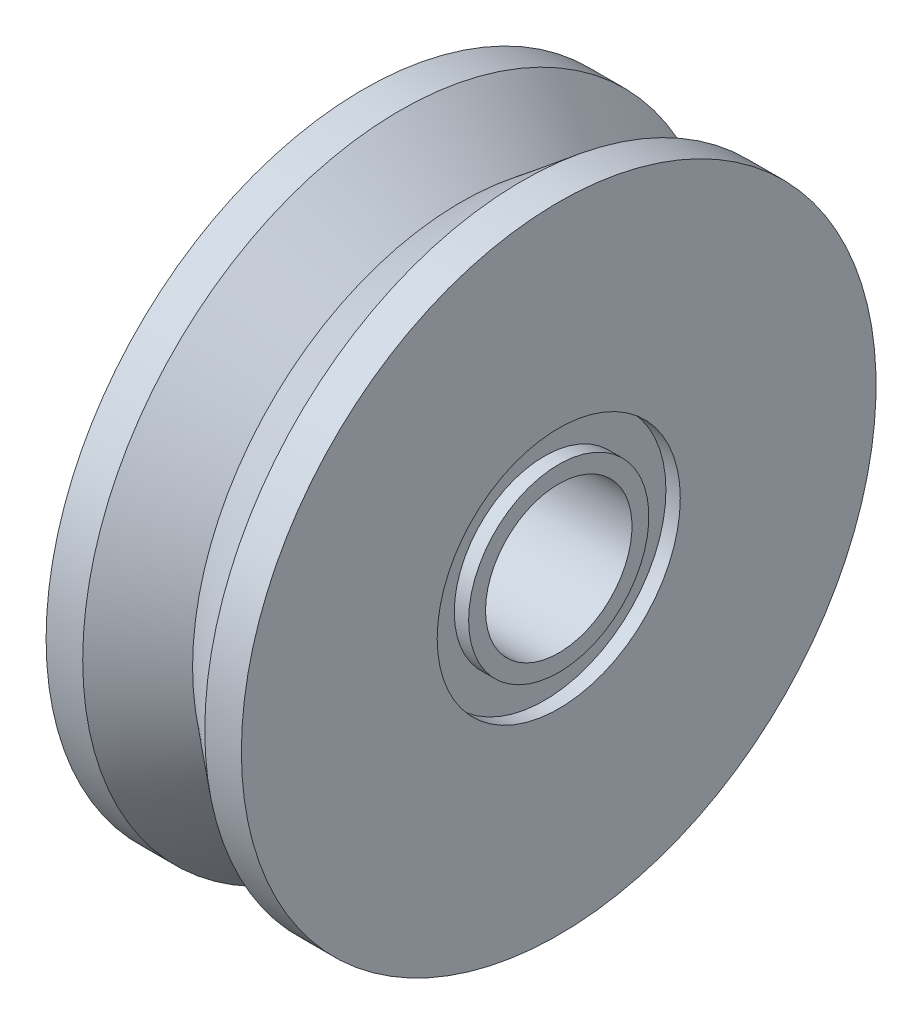
ISO-10303-21;
HEADER;
FILE_DESCRIPTION(('STEP AP214'),'2;1');
FILE_NAME('part.step','',(''),(''),'','','');
FILE_SCHEMA(('AUTOMOTIVE_DESIGN { 1 0 10303 214 1 1 1 1 }'));
ENDSEC;
DATA;
#1=APPLICATION_CONTEXT('core data for automotive mechanical design processes');
#2=APPLICATION_PROTOCOL_DEFINITION('international standard','automotive_design',2000,#1);
#3=PRODUCT_CONTEXT('',#1,'mechanical');
#4=PRODUCT('Part','Part','',(#3));
#5=PRODUCT_RELATED_PRODUCT_CATEGORY('part','',(#4));
#6=PRODUCT_DEFINITION_FORMATION('','',#4);
#7=PRODUCT_DEFINITION_CONTEXT('part definition',#1,'design');
#8=PRODUCT_DEFINITION('design','',#6,#7);
#9=PRODUCT_DEFINITION_SHAPE('','',#8);
#10=(LENGTH_UNIT() NAMED_UNIT(*) SI_UNIT(.MILLI.,.METRE.));
#11=(NAMED_UNIT(*) PLANE_ANGLE_UNIT() SI_UNIT($,.RADIAN.));
#12=(NAMED_UNIT(*) SI_UNIT($,.STERADIAN.) SOLID_ANGLE_UNIT());
#13=UNCERTAINTY_MEASURE_WITH_UNIT(LENGTH_MEASURE(1.E-05),#10,'distance_accuracy_value','');
#14=(GEOMETRIC_REPRESENTATION_CONTEXT(3) GLOBAL_UNCERTAINTY_ASSIGNED_CONTEXT((#13)) GLOBAL_UNIT_ASSIGNED_CONTEXT((#10,
#11,#12)) REPRESENTATION_CONTEXT('',''));
#15=CARTESIAN_POINT('',(0.,0.,0.));
#16=DIRECTION('',(0.,0.,1.));
#17=DIRECTION('',(1.,0.,0.));
#18=AXIS2_PLACEMENT_3D('',#15,#16,#17);
#19=CARTESIAN_POINT('',(0.,1.5,0.));
#20=DIRECTION('',(1.,0.,0.));
#21=DIRECTION('',(0.,0.,-1.));
#22=AXIS2_PLACEMENT_3D('',#19,#20,#21);
#23=PLANE('',#22);
#24=CARTESIAN_POINT('',(0.,0.,0.));
#25=DIRECTION('',(-1.,0.,0.));
#26=DIRECTION('',(0.,0.,1.));
#27=AXIS2_PLACEMENT_3D('',#24,#25,#26);
#28=CIRCLE('',#27,1.5);
#29=CARTESIAN_POINT('',(0.,0.,1.5));
#30=VERTEX_POINT('',#29);
#31=EDGE_CURVE('E77',#30,#30,#28,.T.);
#32=ORIENTED_EDGE('',*,*,#31,.F.);
#33=EDGE_LOOP('',(#32));
#34=FACE_BOUND('',#33,.T.);
#35=CARTESIAN_POINT('',(0.,0.,0.));
#36=DIRECTION('',(-1.,0.,0.));
#37=DIRECTION('',(0.,0.,1.));
#38=AXIS2_PLACEMENT_3D('',#35,#36,#37);
#39=CIRCLE('',#38,1.84615384615385);
#40=CARTESIAN_POINT('',(0.,0.,1.84615384615385));
#41=VERTEX_POINT('',#40);
#42=EDGE_CURVE('E10',#41,#41,#39,.T.);
#43=ORIENTED_EDGE('',*,*,#42,.T.);
#44=EDGE_LOOP('',(#43));
#45=FACE_BOUND('',#44,.T.);
#46=ADVANCED_FACE('F28',(#34,#45),#23,.F.);
#47=CARTESIAN_POINT('',(0.,0.,0.));
#48=DIRECTION('',(-1.,0.,0.));
#49=DIRECTION('',(0.,0.,1.));
#50=AXIS2_PLACEMENT_3D('',#47,#48,#49);
#51=CYLINDRICAL_SURFACE('',#50,1.84615384615385);
#52=ORIENTED_EDGE('',*,*,#42,.F.);
#53=EDGE_LOOP('',(#52));
#54=FACE_BOUND('',#53,.T.);
#55=CARTESIAN_POINT('',(0.293706293706293,0.,0.));
#56=DIRECTION('',(-1.,0.,0.));
#57=DIRECTION('',(0.,0.,1.));
#58=AXIS2_PLACEMENT_3D('',#55,#56,#57);
#59=CIRCLE('',#58,1.84615384615385);
#60=CARTESIAN_POINT('',(0.293706293706293,0.,1.84615384615385));
#61=VERTEX_POINT('',#60);
#62=EDGE_CURVE('E34',#61,#61,#59,.T.);
#63=ORIENTED_EDGE('',*,*,#62,.T.);
#64=EDGE_LOOP('',(#63));
#65=FACE_BOUND('',#64,.T.);
#66=ADVANCED_FACE('F84',(#54,#65),#51,.T.);
#67=CARTESIAN_POINT('',(0.293706293706293,1.84615384615385,0.));
#68=DIRECTION('',(1.,0.,0.));
#69=DIRECTION('',(0.,0.,-1.));
#70=AXIS2_PLACEMENT_3D('',#67,#68,#69);
#71=PLANE('',#70);
#72=ORIENTED_EDGE('',*,*,#62,.F.);
#73=EDGE_LOOP('',(#72));
#74=FACE_BOUND('',#73,.T.);
#75=CARTESIAN_POINT('',(0.293706293706293,0.,0.));
#76=DIRECTION('',(-1.,0.,0.));
#77=DIRECTION('',(0.,0.,1.));
#78=AXIS2_PLACEMENT_3D('',#75,#76,#77);
#79=CIRCLE('',#78,2.48951048951049);
#80=CARTESIAN_POINT('',(0.293706293706293,0.,2.48951048951049));
#81=VERTEX_POINT('',#80);
#82=EDGE_CURVE('E38',#81,#81,#79,.T.);
#83=ORIENTED_EDGE('',*,*,#82,.T.);
#84=EDGE_LOOP('',(#83));
#85=FACE_BOUND('',#84,.T.);
#86=ADVANCED_FACE('F88',(#74,#85),#71,.F.);
#87=CARTESIAN_POINT('',(0.,0.,0.));
#88=DIRECTION('',(-1.,0.,0.));
#89=DIRECTION('',(0.,0.,1.));
#90=AXIS2_PLACEMENT_3D('',#87,#88,#89);
#91=CYLINDRICAL_SURFACE('',#90,2.48951048951049);
#92=ORIENTED_EDGE('',*,*,#82,.F.);
#93=EDGE_LOOP('',(#92));
#94=FACE_BOUND('',#93,.T.);
#95=CARTESIAN_POINT('',(0.,0.,0.));
#96=DIRECTION('',(-1.,0.,0.));
#97=DIRECTION('',(0.,0.,1.));
#98=AXIS2_PLACEMENT_3D('',#95,#96,#97);
#99=CIRCLE('',#98,2.48951048951049);
#100=CARTESIAN_POINT('',(0.,0.,2.48951048951049));
#101=VERTEX_POINT('',#100);
#102=EDGE_CURVE('E42',#101,#101,#99,.T.);
#103=ORIENTED_EDGE('',*,*,#102,.T.);
#104=EDGE_LOOP('',(#103));
#105=FACE_BOUND('',#104,.T.);
#106=ADVANCED_FACE('F93',(#94,#105),#91,.F.);
#107=CARTESIAN_POINT('',(0.,2.48951048951049,0.));
#108=DIRECTION('',(1.,0.,0.));
#109=DIRECTION('',(0.,0.,-1.));
#110=AXIS2_PLACEMENT_3D('',#107,#108,#109);
#111=PLANE('',#110);
#112=ORIENTED_EDGE('',*,*,#102,.F.);
#113=EDGE_LOOP('',(#112));
#114=FACE_BOUND('',#113,.T.);
#115=CARTESIAN_POINT('',(0.,0.,0.));
#116=DIRECTION('',(-1.,0.,0.));
#117=DIRECTION('',(0.,0.,1.));
#118=AXIS2_PLACEMENT_3D('',#115,#116,#117);
#119=CIRCLE('',#118,6.5);
#120=CARTESIAN_POINT('',(0.,0.,6.5));
#121=VERTEX_POINT('',#120);
#122=EDGE_CURVE('E47',#121,#121,#119,.T.);
#123=ORIENTED_EDGE('',*,*,#122,.T.);
#124=EDGE_LOOP('',(#123));
#125=FACE_BOUND('',#124,.T.);
#126=ADVANCED_FACE('F99',(#114,#125),#111,.F.);
#127=CARTESIAN_POINT('',(0.,0.,0.));
#128=DIRECTION('',(-1.,0.,0.));
#129=DIRECTION('',(0.,0.,1.));
#130=AXIS2_PLACEMENT_3D('',#127,#128,#129);
#131=CYLINDRICAL_SURFACE('',#130,6.5);
#132=ORIENTED_EDGE('',*,*,#122,.F.);
#133=EDGE_LOOP('',(#132));
#134=FACE_BOUND('',#133,.T.);
#135=CARTESIAN_POINT('',(0.75,0.,0.));
#136=DIRECTION('',(-1.,0.,0.));
#137=DIRECTION('',(0.,0.,1.));
#138=AXIS2_PLACEMENT_3D('',#135,#136,#137);
#139=CIRCLE('',#138,6.5);
#140=CARTESIAN_POINT('',(0.75,0.,6.5));
#141=VERTEX_POINT('',#140);
#142=EDGE_CURVE('E50',#141,#141,#139,.T.);
#143=ORIENTED_EDGE('',*,*,#142,.T.);
#144=EDGE_LOOP('',(#143));
#145=FACE_BOUND('',#144,.T.);
#146=ADVANCED_FACE('F103',(#134,#145),#131,.T.);
#147=CARTESIAN_POINT('',(2.,0.,0.));
#148=DIRECTION('',(-1.,0.,0.));
#149=DIRECTION('',(0.,0.,1.));
#150=AXIS2_PLACEMENT_3D('',#147,#148,#149);
#151=CONICAL_SURFACE('',#150,5.5,0.674740942223553);
#152=ORIENTED_EDGE('',*,*,#142,.F.);
#153=EDGE_LOOP('',(#152));
#154=FACE_BOUND('',#153,.T.);
#155=CARTESIAN_POINT('',(2.,0.,0.));
#156=DIRECTION('',(-1.,0.,0.));
#157=DIRECTION('',(0.,0.,1.));
#158=AXIS2_PLACEMENT_3D('',#155,#156,#157);
#159=CIRCLE('',#158,5.5);
#160=CARTESIAN_POINT('',(2.,0.,5.5));
#161=VERTEX_POINT('',#160);
#162=EDGE_CURVE('E53',#161,#161,#159,.T.);
#163=ORIENTED_EDGE('',*,*,#162,.T.);
#164=EDGE_LOOP('',(#163));
#165=FACE_BOUND('',#164,.T.);
#166=ADVANCED_FACE('F107',(#154,#165),#151,.T.);
#167=CARTESIAN_POINT('',(3.25,0.,0.));
#168=DIRECTION('',(1.,0.,0.));
#169=DIRECTION('',(0.,0.,-1.));
#170=AXIS2_PLACEMENT_3D('',#167,#168,#169);
#171=CONICAL_SURFACE('',#170,6.5,0.674740942223553);
#172=ORIENTED_EDGE('',*,*,#162,.F.);
#173=EDGE_LOOP('',(#172));
#174=FACE_BOUND('',#173,.T.);
#175=CARTESIAN_POINT('',(3.25,0.,0.));
#176=DIRECTION('',(-1.,0.,0.));
#177=DIRECTION('',(0.,0.,1.));
#178=AXIS2_PLACEMENT_3D('',#175,#176,#177);
#179=CIRCLE('',#178,6.5);
#180=CARTESIAN_POINT('',(3.25,0.,6.5));
#181=VERTEX_POINT('',#180);
#182=EDGE_CURVE('E56',#181,#181,#179,.T.);
#183=ORIENTED_EDGE('',*,*,#182,.T.);
#184=EDGE_LOOP('',(#183));
#185=FACE_BOUND('',#184,.T.);
#186=ADVANCED_FACE('F111',(#174,#185),#171,.T.);
#187=CARTESIAN_POINT('',(0.,0.,0.));
#188=DIRECTION('',(-1.,0.,0.));
#189=DIRECTION('',(0.,0.,1.));
#190=AXIS2_PLACEMENT_3D('',#187,#188,#189);
#191=CYLINDRICAL_SURFACE('',#190,6.5);
#192=ORIENTED_EDGE('',*,*,#182,.F.);
#193=EDGE_LOOP('',(#192));
#194=FACE_BOUND('',#193,.T.);
#195=CARTESIAN_POINT('',(4.,0.,0.));
#196=DIRECTION('',(-1.,0.,0.));
#197=DIRECTION('',(0.,0.,1.));
#198=AXIS2_PLACEMENT_3D('',#195,#196,#197);
#199=CIRCLE('',#198,6.5);
#200=CARTESIAN_POINT('',(4.,0.,6.5));
#201=VERTEX_POINT('',#200);
#202=EDGE_CURVE('E59',#201,#201,#199,.T.);
#203=ORIENTED_EDGE('',*,*,#202,.T.);
#204=EDGE_LOOP('',(#203));
#205=FACE_BOUND('',#204,.T.);
#206=ADVANCED_FACE('F115',(#194,#205),#191,.T.);
#207=CARTESIAN_POINT('',(4.,2.48951048951049,0.));
#208=DIRECTION('',(-1.,0.,0.));
#209=DIRECTION('',(0.,0.,1.));
#210=AXIS2_PLACEMENT_3D('',#207,#208,#209);
#211=PLANE('',#210);
#212=ORIENTED_EDGE('',*,*,#202,.F.);
#213=EDGE_LOOP('',(#212));
#214=FACE_BOUND('',#213,.T.);
#215=CARTESIAN_POINT('',(4.,0.,0.));
#216=DIRECTION('',(-1.,0.,0.));
#217=DIRECTION('',(0.,0.,1.));
#218=AXIS2_PLACEMENT_3D('',#215,#216,#217);
#219=CIRCLE('',#218,2.48951048951049);
#220=CARTESIAN_POINT('',(4.,0.,2.48951048951049));
#221=VERTEX_POINT('',#220);
#222=EDGE_CURVE('E62',#221,#221,#219,.T.);
#223=ORIENTED_EDGE('',*,*,#222,.T.);
#224=EDGE_LOOP('',(#223));
#225=FACE_BOUND('',#224,.T.);
#226=ADVANCED_FACE('F119',(#214,#225),#211,.F.);
#227=CARTESIAN_POINT('',(0.,0.,0.));
#228=DIRECTION('',(-1.,0.,0.));
#229=DIRECTION('',(0.,0.,1.));
#230=AXIS2_PLACEMENT_3D('',#227,#228,#229);
#231=CYLINDRICAL_SURFACE('',#230,2.48951048951049);
#232=ORIENTED_EDGE('',*,*,#222,.F.);
#233=EDGE_LOOP('',(#232));
#234=FACE_BOUND('',#233,.T.);
#235=CARTESIAN_POINT('',(3.70629370629371,0.,0.));
#236=DIRECTION('',(-1.,0.,0.));
#237=DIRECTION('',(0.,0.,1.));
#238=AXIS2_PLACEMENT_3D('',#235,#236,#237);
#239=CIRCLE('',#238,2.48951048951049);
#240=CARTESIAN_POINT('',(3.70629370629371,0.,2.48951048951049));
#241=VERTEX_POINT('',#240);
#242=EDGE_CURVE('E65',#241,#241,#239,.T.);
#243=ORIENTED_EDGE('',*,*,#242,.T.);
#244=EDGE_LOOP('',(#243));
#245=FACE_BOUND('',#244,.T.);
#246=ADVANCED_FACE('F123',(#234,#245),#231,.F.);
#247=CARTESIAN_POINT('',(3.70629370629371,1.84615384615385,0.));
#248=DIRECTION('',(-1.,0.,0.));
#249=DIRECTION('',(0.,0.,1.));
#250=AXIS2_PLACEMENT_3D('',#247,#248,#249);
#251=PLANE('',#250);
#252=ORIENTED_EDGE('',*,*,#242,.F.);
#253=EDGE_LOOP('',(#252));
#254=FACE_BOUND('',#253,.T.);
#255=CARTESIAN_POINT('',(3.70629370629371,0.,0.));
#256=DIRECTION('',(-1.,0.,0.));
#257=DIRECTION('',(0.,0.,1.));
#258=AXIS2_PLACEMENT_3D('',#255,#256,#257);
#259=CIRCLE('',#258,1.84615384615385);
#260=CARTESIAN_POINT('',(3.70629370629371,0.,1.84615384615385));
#261=VERTEX_POINT('',#260);
#262=EDGE_CURVE('E68',#261,#261,#259,.T.);
#263=ORIENTED_EDGE('',*,*,#262,.T.);
#264=EDGE_LOOP('',(#263));
#265=FACE_BOUND('',#264,.T.);
#266=ADVANCED_FACE('F127',(#254,#265),#251,.F.);
#267=CARTESIAN_POINT('',(0.,0.,0.));
#268=DIRECTION('',(-1.,0.,0.));
#269=DIRECTION('',(0.,0.,1.));
#270=AXIS2_PLACEMENT_3D('',#267,#268,#269);
#271=CYLINDRICAL_SURFACE('',#270,1.84615384615385);
#272=ORIENTED_EDGE('',*,*,#262,.F.);
#273=EDGE_LOOP('',(#272));
#274=FACE_BOUND('',#273,.T.);
#275=CARTESIAN_POINT('',(4.,0.,0.));
#276=DIRECTION('',(-1.,0.,0.));
#277=DIRECTION('',(0.,0.,1.));
#278=AXIS2_PLACEMENT_3D('',#275,#276,#277);
#279=CIRCLE('',#278,1.84615384615385);
#280=CARTESIAN_POINT('',(4.,0.,1.84615384615385));
#281=VERTEX_POINT('',#280);
#282=EDGE_CURVE('E71',#281,#281,#279,.T.);
#283=ORIENTED_EDGE('',*,*,#282,.T.);
#284=EDGE_LOOP('',(#283));
#285=FACE_BOUND('',#284,.T.);
#286=ADVANCED_FACE('F131',(#274,#285),#271,.T.);
#287=CARTESIAN_POINT('',(4.,1.84615384615385,0.));
#288=DIRECTION('',(-1.,0.,0.));
#289=DIRECTION('',(0.,0.,1.));
#290=AXIS2_PLACEMENT_3D('',#287,#288,#289);
#291=PLANE('',#290);
#292=ORIENTED_EDGE('',*,*,#282,.F.);
#293=EDGE_LOOP('',(#292));
#294=FACE_BOUND('',#293,.T.);
#295=CARTESIAN_POINT('',(4.,0.,0.));
#296=DIRECTION('',(-1.,0.,0.));
#297=DIRECTION('',(0.,0.,1.));
#298=AXIS2_PLACEMENT_3D('',#295,#296,#297);
#299=CIRCLE('',#298,1.5);
#300=CARTESIAN_POINT('',(4.,0.,1.5));
#301=VERTEX_POINT('',#300);
#302=EDGE_CURVE('E74',#301,#301,#299,.T.);
#303=ORIENTED_EDGE('',*,*,#302,.T.);
#304=EDGE_LOOP('',(#303));
#305=FACE_BOUND('',#304,.T.);
#306=ADVANCED_FACE('F135',(#294,#305),#291,.F.);
#307=CARTESIAN_POINT('',(0.,0.,0.));
#308=DIRECTION('',(-1.,0.,0.));
#309=DIRECTION('',(0.,0.,1.));
#310=AXIS2_PLACEMENT_3D('',#307,#308,#309);
#311=CYLINDRICAL_SURFACE('',#310,1.5);
#312=ORIENTED_EDGE('',*,*,#302,.F.);
#313=EDGE_LOOP('',(#312));
#314=FACE_BOUND('',#313,.T.);
#315=ORIENTED_EDGE('',*,*,#31,.T.);
#316=EDGE_LOOP('',(#315));
#317=FACE_BOUND('',#316,.T.);
#318=ADVANCED_FACE('F81',(#314,#317),#311,.F.);
#319=CLOSED_SHELL('',(#46,#66,#86,#106,#126,#146,#166,#186,#206,#226,#246,#266,#286,#306,#318));
#320=MANIFOLD_SOLID_BREP('B2',#319);
#321=ADVANCED_BREP_SHAPE_REPRESENTATION('',(#18,#320),#14);
#322=SHAPE_DEFINITION_REPRESENTATION(#9,#321);
ENDSEC;
END-ISO-10303-21;
